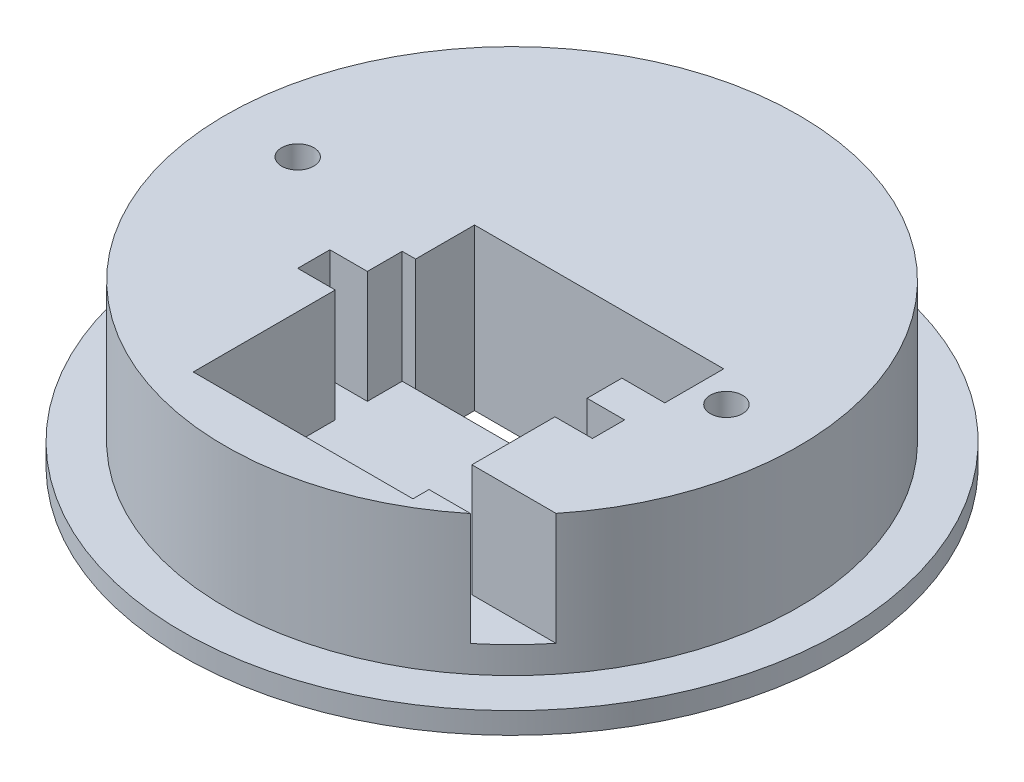
ISO-10303-21;
HEADER;
FILE_DESCRIPTION(('STEP AP214'),'2;1');
FILE_NAME('part.step','',(''),(''),'','','');
FILE_SCHEMA(('AUTOMOTIVE_DESIGN { 1 0 10303 214 1 1 1 1 }'));
ENDSEC;
DATA;
#1=APPLICATION_CONTEXT('core data for automotive mechanical design processes');
#2=APPLICATION_PROTOCOL_DEFINITION('international standard','automotive_design',2000,#1);
#3=PRODUCT_CONTEXT('',#1,'mechanical');
#4=PRODUCT('Part','Part','',(#3));
#5=PRODUCT_RELATED_PRODUCT_CATEGORY('part','',(#4));
#6=PRODUCT_DEFINITION_FORMATION('','',#4);
#7=PRODUCT_DEFINITION_CONTEXT('part definition',#1,'design');
#8=PRODUCT_DEFINITION('design','',#6,#7);
#9=PRODUCT_DEFINITION_SHAPE('','',#8);
#10=(LENGTH_UNIT() NAMED_UNIT(*) SI_UNIT(.MILLI.,.METRE.));
#11=(NAMED_UNIT(*) PLANE_ANGLE_UNIT() SI_UNIT($,.RADIAN.));
#12=(NAMED_UNIT(*) SI_UNIT($,.STERADIAN.) SOLID_ANGLE_UNIT());
#13=UNCERTAINTY_MEASURE_WITH_UNIT(LENGTH_MEASURE(1.E-05),#10,'distance_accuracy_value','');
#14=(GEOMETRIC_REPRESENTATION_CONTEXT(3) GLOBAL_UNCERTAINTY_ASSIGNED_CONTEXT((#13)) GLOBAL_UNIT_ASSIGNED_CONTEXT((#10,
#11,#12)) REPRESENTATION_CONTEXT('',''));
#15=CARTESIAN_POINT('',(0.,0.,0.));
#16=DIRECTION('',(0.,0.,1.));
#17=DIRECTION('',(1.,0.,0.));
#18=AXIS2_PLACEMENT_3D('',#15,#16,#17);
#19=CARTESIAN_POINT('',(16.,19.,-56.4116882454314));
#20=DIRECTION('',(0.,0.,1.));
#21=DIRECTION('',(1.,0.,0.));
#22=AXIS2_PLACEMENT_3D('',#19,#20,#21);
#23=CYLINDRICAL_SURFACE('',#22,18.);
#24=CARTESIAN_POINT('',(16.,19.,5.5));
#25=DIRECTION('',(0.,0.,-1.));
#26=DIRECTION('',(-1.,0.,0.));
#27=AXIS2_PLACEMENT_3D('',#24,#25,#26);
#28=CIRCLE('',#27,18.);
#29=CARTESIAN_POINT('',(34.,19.,5.5));
#30=VERTEX_POINT('',#29);
#31=CARTESIAN_POINT('',(12.5,1.34355641699043,5.5));
#32=VERTEX_POINT('',#31);
#33=EDGE_CURVE('E240',#30,#32,#28,.T.);
#34=ORIENTED_EDGE('',*,*,#33,.F.);
#35=DIRECTION('',(0.,0.,-1.));
#36=VECTOR('',#35,1.);
#37=CARTESIAN_POINT('',(34.,19.,5.5));
#38=LINE('',#37,#36);
#39=CARTESIAN_POINT('',(34.,19.,-5.50000000000001));
#40=VERTEX_POINT('',#39);
#41=EDGE_CURVE('E247',#30,#40,#38,.T.);
#42=ORIENTED_EDGE('',*,*,#41,.T.);
#43=CARTESIAN_POINT('',(16.,19.,-5.50000000000001));
#44=DIRECTION('',(0.,0.,1.));
#45=DIRECTION('',(1.,0.,0.));
#46=AXIS2_PLACEMENT_3D('',#43,#44,#45);
#47=CIRCLE('',#46,18.);
#48=CARTESIAN_POINT('',(12.5,1.34355641699043,-5.5));
#49=VERTEX_POINT('',#48);
#50=EDGE_CURVE('E256',#49,#40,#47,.T.);
#51=ORIENTED_EDGE('',*,*,#50,.F.);
#52=DIRECTION('',(0.,0.,1.));
#53=VECTOR('',#52,1.);
#54=CARTESIAN_POINT('',(12.5,1.34355641699043,-56.4116882454314));
#55=LINE('',#54,#53);
#56=EDGE_CURVE('E254',#32,#49,#55,.F.);
#57=ORIENTED_EDGE('',*,*,#56,.F.);
#58=EDGE_LOOP('',(#34,#42,#51,#57));
#59=FACE_BOUND('',#58,.T.);
#60=ADVANCED_FACE('F82',(#59),#23,.F.);
#61=CARTESIAN_POINT('',(0.,0.,0.));
#62=DIRECTION('',(0.,1.,0.));
#63=DIRECTION('',(0.,0.,1.));
#64=AXIS2_PLACEMENT_3D('',#61,#62,#63);
#65=CYLINDRICAL_SURFACE('',#64,53.5);
#66=CARTESIAN_POINT('',(0.,4.,0.));
#67=DIRECTION('',(0.,-1.,0.));
#68=DIRECTION('',(0.,0.,-1.));
#69=AXIS2_PLACEMENT_3D('',#66,#67,#68);
#70=CIRCLE('',#69,53.5);
#71=CARTESIAN_POINT('',(0.,4.,-53.5));
#72=VERTEX_POINT('',#71);
#73=EDGE_CURVE('E266',#72,#72,#70,.T.);
#74=ORIENTED_EDGE('',*,*,#73,.F.);
#75=EDGE_LOOP('',(#74));
#76=FACE_BOUND('',#75,.T.);
#77=CARTESIAN_POINT('',(0.,30.,0.));
#78=DIRECTION('',(0.,1.,0.));
#79=DIRECTION('',(0.,0.,1.));
#80=AXIS2_PLACEMENT_3D('',#77,#78,#79);
#81=CIRCLE('',#80,53.5);
#82=CARTESIAN_POINT('',(41.7133072292284,30.,33.5));
#83=VERTEX_POINT('',#82);
#84=CARTESIAN_POINT('',(33.7638860322683,30.,41.5));
#85=VERTEX_POINT('',#84);
#86=EDGE_CURVE('E273',#83,#85,#81,.T.);
#87=ORIENTED_EDGE('',*,*,#86,.F.);
#88=DIRECTION('',(0.,1.,0.));
#89=VECTOR('',#88,1.);
#90=CARTESIAN_POINT('',(41.7133072292284,0.,33.5));
#91=LINE('',#90,#89);
#92=CARTESIAN_POINT('',(41.7133072292284,9.,33.5));
#93=VERTEX_POINT('',#92);
#94=EDGE_CURVE('E12',#83,#93,#91,.F.);
#95=ORIENTED_EDGE('',*,*,#94,.T.);
#96=CARTESIAN_POINT('',(0.,9.,0.));
#97=DIRECTION('',(0.,1.,0.));
#98=DIRECTION('',(0.,0.,1.));
#99=AXIS2_PLACEMENT_3D('',#96,#97,#98);
#100=CIRCLE('',#99,53.5);
#101=CARTESIAN_POINT('',(33.7638860322683,9.,41.5));
#102=VERTEX_POINT('',#101);
#103=EDGE_CURVE('E257',#93,#102,#100,.F.);
#104=ORIENTED_EDGE('',*,*,#103,.T.);
#105=DIRECTION('',(0.,1.,0.));
#106=VECTOR('',#105,1.);
#107=CARTESIAN_POINT('',(33.7638860322683,0.,41.5));
#108=LINE('',#107,#106);
#109=EDGE_CURVE('E90',#85,#102,#108,.F.);
#110=ORIENTED_EDGE('',*,*,#109,.F.);
#111=EDGE_LOOP('',(#87,#95,#104,#110));
#112=FACE_BOUND('',#111,.T.);
#113=ADVANCED_FACE('F337',(#76,#112),#65,.T.);
#114=CARTESIAN_POINT('',(-48.8644676542519,30.,-38.9681126161708));
#115=DIRECTION('',(0.,1.,0.));
#116=DIRECTION('',(0.,0.,1.));
#117=AXIS2_PLACEMENT_3D('',#114,#115,#116);
#118=PLANE('',#117);
#119=DIRECTION('',(0.,0.,-1.));
#120=VECTOR('',#119,1.);
#121=CARTESIAN_POINT('',(34.,30.,5.5));
#122=LINE('',#121,#120);
#123=CARTESIAN_POINT('',(34.,30.,5.5));
#124=VERTEX_POINT('',#123);
#125=CARTESIAN_POINT('',(34.,30.,-5.5));
#126=VERTEX_POINT('',#125);
#127=EDGE_CURVE('E251',#124,#126,#122,.T.);
#128=ORIENTED_EDGE('',*,*,#127,.F.);
#129=DIRECTION('',(1.,0.,0.));
#130=VECTOR('',#129,1.);
#131=CARTESIAN_POINT('',(-12.5,30.,5.5));
#132=LINE('',#131,#130);
#133=CARTESIAN_POINT('',(26.,30.,5.5));
#134=VERTEX_POINT('',#133);
#135=EDGE_CURVE('E243',#134,#124,#132,.T.);
#136=ORIENTED_EDGE('',*,*,#135,.F.);
#137=DIRECTION('',(0.,0.,-1.));
#138=VECTOR('',#137,1.);
#139=CARTESIAN_POINT('',(26.,30.,0.));
#140=LINE('',#139,#138);
#141=CARTESIAN_POINT('',(26.,30.,12.));
#142=VERTEX_POINT('',#141);
#143=EDGE_CURVE('E397',#142,#134,#140,.T.);
#144=ORIENTED_EDGE('',*,*,#143,.F.);
#145=DIRECTION('',(1.,0.,0.));
#146=VECTOR('',#145,1.);
#147=CARTESIAN_POINT('',(0.,30.,12.));
#148=LINE('',#147,#146);
#149=CARTESIAN_POINT('',(33.,30.,12.));
#150=VERTEX_POINT('',#149);
#151=EDGE_CURVE('E398',#142,#150,#148,.T.);
#152=ORIENTED_EDGE('',*,*,#151,.T.);
#153=DIRECTION('',(0.,0.,-1.));
#154=VECTOR('',#153,1.);
#155=CARTESIAN_POINT('',(33.,30.,0.));
#156=LINE('',#155,#154);
#157=CARTESIAN_POINT('',(33.,30.,18.));
#158=VERTEX_POINT('',#157);
#159=EDGE_CURVE('E401',#158,#150,#156,.T.);
#160=ORIENTED_EDGE('',*,*,#159,.F.);
#161=DIRECTION('',(1.,0.,0.));
#162=VECTOR('',#161,1.);
#163=CARTESIAN_POINT('',(0.,30.,18.));
#164=LINE('',#163,#162);
#165=CARTESIAN_POINT('',(26.,30.,18.));
#166=VERTEX_POINT('',#165);
#167=EDGE_CURVE('E404',#166,#158,#164,.T.);
#168=ORIENTED_EDGE('',*,*,#167,.F.);
#169=CARTESIAN_POINT('',(26.,30.,33.5));
#170=VERTEX_POINT('',#169);
#171=EDGE_CURVE('E347',#170,#166,#140,.T.);
#172=ORIENTED_EDGE('',*,*,#171,.F.);
#173=DIRECTION('',(1.,0.,0.));
#174=VECTOR('',#173,1.);
#175=CARTESIAN_POINT('',(26.,30.,33.5));
#176=LINE('',#175,#174);
#177=EDGE_CURVE('E335',#170,#83,#176,.T.);
#178=ORIENTED_EDGE('',*,*,#177,.T.);
#179=ORIENTED_EDGE('',*,*,#86,.T.);
#180=DIRECTION('',(1.,0.,0.));
#181=VECTOR('',#180,1.);
#182=CARTESIAN_POINT('',(26.,30.,41.5));
#183=LINE('',#182,#181);
#184=CARTESIAN_POINT('',(26.,30.,41.5));
#185=VERTEX_POINT('',#184);
#186=EDGE_CURVE('E245',#185,#85,#183,.T.);
#187=ORIENTED_EDGE('',*,*,#186,.F.);
#188=CARTESIAN_POINT('',(26.,30.,44.5));
#189=VERTEX_POINT('',#188);
#190=EDGE_CURVE('E407',#189,#185,#140,.T.);
#191=ORIENTED_EDGE('',*,*,#190,.F.);
#192=DIRECTION('',(1.,0.,0.));
#193=VECTOR('',#192,1.);
#194=CARTESIAN_POINT('',(0.,30.,44.5));
#195=LINE('',#194,#193);
#196=CARTESIAN_POINT('',(-15.,30.,44.5));
#197=VERTEX_POINT('',#196);
#198=EDGE_CURVE('E350',#197,#189,#195,.T.);
#199=ORIENTED_EDGE('',*,*,#198,.F.);
#200=DIRECTION('',(0.,0.,-1.));
#201=VECTOR('',#200,1.);
#202=CARTESIAN_POINT('',(-15.,30.,0.));
#203=LINE('',#202,#201);
#204=CARTESIAN_POINT('',(-15.,30.,18.));
#205=VERTEX_POINT('',#204);
#206=EDGE_CURVE('E385',#197,#205,#203,.T.);
#207=ORIENTED_EDGE('',*,*,#206,.T.);
#208=DIRECTION('',(-1.,0.,0.));
#209=VECTOR('',#208,1.);
#210=CARTESIAN_POINT('',(0.,30.,18.));
#211=LINE('',#210,#209);
#212=CARTESIAN_POINT('',(-22.,30.,18.));
#213=VERTEX_POINT('',#212);
#214=EDGE_CURVE('E382',#205,#213,#211,.T.);
#215=ORIENTED_EDGE('',*,*,#214,.T.);
#216=DIRECTION('',(0.,0.,1.));
#217=VECTOR('',#216,1.);
#218=CARTESIAN_POINT('',(-22.,30.,0.));
#219=LINE('',#218,#217);
#220=CARTESIAN_POINT('',(-22.,30.,12.));
#221=VERTEX_POINT('',#220);
#222=EDGE_CURVE('E386',#221,#213,#219,.T.);
#223=ORIENTED_EDGE('',*,*,#222,.F.);
#224=DIRECTION('',(-1.,0.,0.));
#225=VECTOR('',#224,1.);
#226=CARTESIAN_POINT('',(0.,30.,12.));
#227=LINE('',#226,#225);
#228=CARTESIAN_POINT('',(-15.,30.,12.));
#229=VERTEX_POINT('',#228);
#230=EDGE_CURVE('E389',#229,#221,#227,.T.);
#231=ORIENTED_EDGE('',*,*,#230,.F.);
#232=CARTESIAN_POINT('',(-15.,30.,5.5));
#233=VERTEX_POINT('',#232);
#234=EDGE_CURVE('E392',#229,#233,#203,.T.);
#235=ORIENTED_EDGE('',*,*,#234,.T.);
#236=DIRECTION('',(-1.,0.,0.));
#237=VECTOR('',#236,1.);
#238=CARTESIAN_POINT('',(0.,30.,5.5));
#239=LINE('',#238,#237);
#240=CARTESIAN_POINT('',(-12.5,30.,5.50000000000001));
#241=VERTEX_POINT('',#240);
#242=EDGE_CURVE('E395',#241,#233,#239,.T.);
#243=ORIENTED_EDGE('',*,*,#242,.F.);
#244=DIRECTION('',(0.,0.,1.));
#245=VECTOR('',#244,1.);
#246=CARTESIAN_POINT('',(-12.5,30.,-5.5));
#247=LINE('',#246,#245);
#248=CARTESIAN_POINT('',(-12.5,30.,-5.5));
#249=VERTEX_POINT('',#248);
#250=EDGE_CURVE('E291',#249,#241,#247,.T.);
#251=ORIENTED_EDGE('',*,*,#250,.F.);
#252=DIRECTION('',(-1.,0.,0.));
#253=VECTOR('',#252,1.);
#254=CARTESIAN_POINT('',(-12.5,30.,-5.5));
#255=LINE('',#254,#253);
#256=EDGE_CURVE('E296',#126,#249,#255,.T.);
#257=ORIENTED_EDGE('',*,*,#256,.F.);
#258=EDGE_LOOP('',(#128,#136,#144,#152,#160,#168,#172,#178,#179,#187,#191,#199,#207,#215,#223,
#231,#235,#243,#251,#257));
#259=FACE_BOUND('',#258,.T.);
#260=CARTESIAN_POINT('',(40.,30.,0.));
#261=DIRECTION('',(0.,1.,0.));
#262=DIRECTION('',(0.,0.,-1.));
#263=AXIS2_PLACEMENT_3D('',#260,#261,#262);
#264=CIRCLE('',#263,3.);
#265=CARTESIAN_POINT('',(40.,30.,-3.00000000000001));
#266=VERTEX_POINT('',#265);
#267=EDGE_CURVE('E279',#266,#266,#264,.T.);
#268=ORIENTED_EDGE('',*,*,#267,.F.);
#269=EDGE_LOOP('',(#268));
#270=FACE_BOUND('',#269,.T.);
#271=CARTESIAN_POINT('',(-40.,30.,0.));
#272=DIRECTION('',(0.,1.,0.));
#273=DIRECTION('',(0.,0.,1.));
#274=AXIS2_PLACEMENT_3D('',#271,#272,#273);
#275=CIRCLE('',#274,3.);
#276=CARTESIAN_POINT('',(-40.,30.,3.));
#277=VERTEX_POINT('',#276);
#278=EDGE_CURVE('E285',#277,#277,#275,.T.);
#279=ORIENTED_EDGE('',*,*,#278,.F.);
#280=EDGE_LOOP('',(#279));
#281=FACE_BOUND('',#280,.T.);
#282=ADVANCED_FACE('F344',(#259,#270,#281),#118,.T.);
#283=CARTESIAN_POINT('',(12.5,30.,-5.5));
#284=DIRECTION('',(-1.,0.,0.));
#285=DIRECTION('',(0.,0.,1.));
#286=AXIS2_PLACEMENT_3D('',#283,#284,#285);
#287=PLANE('',#286);
#288=DIRECTION('',(0.,-1.,0.));
#289=VECTOR('',#288,1.);
#290=CARTESIAN_POINT('',(12.5,30.,5.5));
#291=LINE('',#290,#289);
#292=CARTESIAN_POINT('',(12.5,0.,5.5));
#293=VERTEX_POINT('',#292);
#294=EDGE_CURVE('E313',#32,#293,#291,.T.);
#295=ORIENTED_EDGE('',*,*,#294,.F.);
#296=ORIENTED_EDGE('',*,*,#56,.T.);
#297=DIRECTION('',(0.,-1.,0.));
#298=VECTOR('',#297,1.);
#299=CARTESIAN_POINT('',(12.5,30.,-5.5));
#300=LINE('',#299,#298);
#301=CARTESIAN_POINT('',(12.5,0.,-5.5));
#302=VERTEX_POINT('',#301);
#303=EDGE_CURVE('E311',#49,#302,#300,.T.);
#304=ORIENTED_EDGE('',*,*,#303,.T.);
#305=DIRECTION('',(0.,0.,-1.));
#306=VECTOR('',#305,1.);
#307=CARTESIAN_POINT('',(12.5,0.,-5.5));
#308=LINE('',#307,#306);
#309=EDGE_CURVE('E304',#293,#302,#308,.T.);
#310=ORIENTED_EDGE('',*,*,#309,.F.);
#311=EDGE_LOOP('',(#295,#296,#304,#310));
#312=FACE_BOUND('',#311,.T.);
#313=ADVANCED_FACE('F448',(#312),#287,.T.);
#314=CARTESIAN_POINT('',(-48.8644676542519,0.,-38.9681126161708));
#315=DIRECTION('',(0.,1.,0.));
#316=DIRECTION('',(0.,0.,1.));
#317=AXIS2_PLACEMENT_3D('',#314,#315,#316);
#318=PLANE('',#317);
#319=CARTESIAN_POINT('',(40.,0.,0.));
#320=DIRECTION('',(0.,1.,0.));
#321=DIRECTION('',(0.,0.,-1.));
#322=AXIS2_PLACEMENT_3D('',#319,#320,#321);
#323=CIRCLE('',#322,3.);
#324=CARTESIAN_POINT('',(40.,0.,-3.00000000000001));
#325=VERTEX_POINT('',#324);
#326=EDGE_CURVE('E278',#325,#325,#323,.T.);
#327=ORIENTED_EDGE('',*,*,#326,.T.);
#328=EDGE_LOOP('',(#327));
#329=FACE_BOUND('',#328,.T.);
#330=CARTESIAN_POINT('',(-40.,0.,0.));
#331=DIRECTION('',(0.,1.,0.));
#332=DIRECTION('',(0.,0.,1.));
#333=AXIS2_PLACEMENT_3D('',#330,#331,#332);
#334=CIRCLE('',#333,3.);
#335=CARTESIAN_POINT('',(-40.,0.,3.));
#336=VERTEX_POINT('',#335);
#337=EDGE_CURVE('E282',#336,#336,#334,.T.);
#338=ORIENTED_EDGE('',*,*,#337,.T.);
#339=EDGE_LOOP('',(#338));
#340=FACE_BOUND('',#339,.T.);
#341=DIRECTION('',(0.,0.,1.));
#342=VECTOR('',#341,1.);
#343=CARTESIAN_POINT('',(-12.5,0.,-5.5));
#344=LINE('',#343,#342);
#345=CARTESIAN_POINT('',(-12.5,0.,-5.5));
#346=VERTEX_POINT('',#345);
#347=CARTESIAN_POINT('',(-12.5,0.,5.5));
#348=VERTEX_POINT('',#347);
#349=EDGE_CURVE('E288',#346,#348,#344,.T.);
#350=ORIENTED_EDGE('',*,*,#349,.T.);
#351=DIRECTION('',(1.,0.,0.));
#352=VECTOR('',#351,1.);
#353=CARTESIAN_POINT('',(-12.5,0.,5.5));
#354=LINE('',#353,#352);
#355=EDGE_CURVE('E301',#348,#293,#354,.T.);
#356=ORIENTED_EDGE('',*,*,#355,.T.);
#357=ORIENTED_EDGE('',*,*,#309,.T.);
#358=DIRECTION('',(-1.,0.,0.));
#359=VECTOR('',#358,1.);
#360=CARTESIAN_POINT('',(-12.5,0.,-5.5));
#361=LINE('',#360,#359);
#362=EDGE_CURVE('E294',#302,#346,#361,.T.);
#363=ORIENTED_EDGE('',*,*,#362,.T.);
#364=EDGE_LOOP('',(#350,#356,#357,#363));
#365=FACE_BOUND('',#364,.T.);
#366=CARTESIAN_POINT('',(0.,0.,0.));
#367=DIRECTION('',(0.,-1.,0.));
#368=DIRECTION('',(0.,0.,-1.));
#369=AXIS2_PLACEMENT_3D('',#366,#367,#368);
#370=CIRCLE('',#369,61.5);
#371=CARTESIAN_POINT('',(0.,0.,-61.5));
#372=VERTEX_POINT('',#371);
#373=EDGE_CURVE('E269',#372,#372,#370,.T.);
#374=ORIENTED_EDGE('',*,*,#373,.T.);
#375=EDGE_LOOP('',(#374));
#376=FACE_BOUND('',#375,.T.);
#377=ADVANCED_FACE('F84',(#329,#340,#365,#376),#318,.F.);
#378=CARTESIAN_POINT('',(-12.5,30.,-5.5));
#379=DIRECTION('',(1.,0.,0.));
#380=DIRECTION('',(0.,0.,-1.));
#381=AXIS2_PLACEMENT_3D('',#378,#379,#380);
#382=PLANE('',#381);
#383=ORIENTED_EDGE('',*,*,#349,.F.);
#384=DIRECTION('',(0.,-1.,0.));
#385=VECTOR('',#384,1.);
#386=CARTESIAN_POINT('',(-12.5,30.,-5.5));
#387=LINE('',#386,#385);
#388=EDGE_CURVE('E298',#249,#346,#387,.T.);
#389=ORIENTED_EDGE('',*,*,#388,.F.);
#390=ORIENTED_EDGE('',*,*,#250,.T.);
#391=DIRECTION('',(0.,-1.,0.));
#392=VECTOR('',#391,1.);
#393=CARTESIAN_POINT('',(-12.5,30.,5.5));
#394=LINE('',#393,#392);
#395=CARTESIAN_POINT('',(-12.5,9.,5.50000000000001));
#396=VERTEX_POINT('',#395);
#397=EDGE_CURVE('E316',#241,#396,#394,.T.);
#398=ORIENTED_EDGE('',*,*,#397,.T.);
#399=EDGE_CURVE('E315',#396,#348,#394,.T.);
#400=ORIENTED_EDGE('',*,*,#399,.T.);
#401=EDGE_LOOP('',(#383,#389,#390,#398,#400));
#402=FACE_BOUND('',#401,.T.);
#403=ADVANCED_FACE('F456',(#402),#382,.T.);
#404=CARTESIAN_POINT('',(-12.5,30.,5.5));
#405=DIRECTION('',(0.,0.,-1.));
#406=DIRECTION('',(-1.,0.,0.));
#407=AXIS2_PLACEMENT_3D('',#404,#405,#406);
#408=PLANE('',#407);
#409=DIRECTION('',(0.,1.,0.));
#410=VECTOR('',#409,1.);
#411=CARTESIAN_POINT('',(34.,19.,5.5));
#412=LINE('',#411,#410);
#413=EDGE_CURVE('E237',#30,#124,#412,.T.);
#414=ORIENTED_EDGE('',*,*,#413,.F.);
#415=ORIENTED_EDGE('',*,*,#33,.T.);
#416=ORIENTED_EDGE('',*,*,#294,.T.);
#417=ORIENTED_EDGE('',*,*,#355,.F.);
#418=ORIENTED_EDGE('',*,*,#399,.F.);
#419=DIRECTION('',(-1.,0.,0.));
#420=VECTOR('',#419,1.);
#421=CARTESIAN_POINT('',(0.,9.,5.5));
#422=LINE('',#421,#420);
#423=CARTESIAN_POINT('',(26.,9.,5.49999999999999));
#424=VERTEX_POINT('',#423);
#425=EDGE_CURVE('E423',#424,#396,#422,.T.);
#426=ORIENTED_EDGE('',*,*,#425,.F.);
#427=DIRECTION('',(0.,1.,0.));
#428=VECTOR('',#427,1.);
#429=CARTESIAN_POINT('',(26.,9.,5.5));
#430=LINE('',#429,#428);
#431=EDGE_CURVE('E368',#424,#134,#430,.T.);
#432=ORIENTED_EDGE('',*,*,#431,.T.);
#433=ORIENTED_EDGE('',*,*,#135,.T.);
#434=EDGE_LOOP('',(#414,#415,#416,#417,#418,#426,#432,#433));
#435=FACE_BOUND('',#434,.T.);
#436=ADVANCED_FACE('F238',(#435),#408,.T.);
#437=CARTESIAN_POINT('',(-12.5,30.,-5.5));
#438=DIRECTION('',(0.,0.,1.));
#439=DIRECTION('',(1.,0.,0.));
#440=AXIS2_PLACEMENT_3D('',#437,#438,#439);
#441=PLANE('',#440);
#442=ORIENTED_EDGE('',*,*,#256,.T.);
#443=ORIENTED_EDGE('',*,*,#388,.T.);
#444=ORIENTED_EDGE('',*,*,#362,.F.);
#445=ORIENTED_EDGE('',*,*,#303,.F.);
#446=ORIENTED_EDGE('',*,*,#50,.T.);
#447=DIRECTION('',(0.,1.,0.));
#448=VECTOR('',#447,1.);
#449=CARTESIAN_POINT('',(34.,19.,-5.5));
#450=LINE('',#449,#448);
#451=EDGE_CURVE('E97',#40,#126,#450,.T.);
#452=ORIENTED_EDGE('',*,*,#451,.T.);
#453=EDGE_LOOP('',(#442,#443,#444,#445,#446,#452));
#454=FACE_BOUND('',#453,.T.);
#455=ADVANCED_FACE('F444',(#454),#441,.T.);
#456=CARTESIAN_POINT('',(-40.,30.,0.));
#457=DIRECTION('',(0.,-1.,0.));
#458=DIRECTION('',(0.,0.,-1.));
#459=AXIS2_PLACEMENT_3D('',#456,#457,#458);
#460=CYLINDRICAL_SURFACE('',#459,3.);
#461=ORIENTED_EDGE('',*,*,#278,.T.);
#462=EDGE_LOOP('',(#461));
#463=FACE_BOUND('',#462,.T.);
#464=ORIENTED_EDGE('',*,*,#337,.F.);
#465=EDGE_LOOP('',(#464));
#466=FACE_BOUND('',#465,.T.);
#467=ADVANCED_FACE('F527',(#463,#466),#460,.F.);
#468=CARTESIAN_POINT('',(40.,30.,0.));
#469=DIRECTION('',(0.,-1.,0.));
#470=DIRECTION('',(0.,0.,-1.));
#471=AXIS2_PLACEMENT_3D('',#468,#469,#470);
#472=CYLINDRICAL_SURFACE('',#471,3.);
#473=ORIENTED_EDGE('',*,*,#267,.T.);
#474=EDGE_LOOP('',(#473));
#475=FACE_BOUND('',#474,.T.);
#476=ORIENTED_EDGE('',*,*,#326,.F.);
#477=EDGE_LOOP('',(#476));
#478=FACE_BOUND('',#477,.T.);
#479=ADVANCED_FACE('F522',(#475,#478),#472,.F.);
#480=CARTESIAN_POINT('',(0.,4.,0.));
#481=DIRECTION('',(0.,-1.,0.));
#482=DIRECTION('',(0.,0.,-1.));
#483=AXIS2_PLACEMENT_3D('',#480,#481,#482);
#484=CYLINDRICAL_SURFACE('',#483,61.5);
#485=CARTESIAN_POINT('',(0.,4.,0.));
#486=DIRECTION('',(0.,-1.,0.));
#487=DIRECTION('',(0.,0.,-1.));
#488=AXIS2_PLACEMENT_3D('',#485,#486,#487);
#489=CIRCLE('',#488,61.5);
#490=CARTESIAN_POINT('',(0.,4.,-61.5));
#491=VERTEX_POINT('',#490);
#492=EDGE_CURVE('E270',#491,#491,#489,.T.);
#493=ORIENTED_EDGE('',*,*,#492,.T.);
#494=EDGE_LOOP('',(#493));
#495=FACE_BOUND('',#494,.T.);
#496=ORIENTED_EDGE('',*,*,#373,.F.);
#497=EDGE_LOOP('',(#496));
#498=FACE_BOUND('',#497,.T.);
#499=ADVANCED_FACE('F519',(#495,#498),#484,.T.);
#500=CARTESIAN_POINT('',(0.,4.,0.));
#501=DIRECTION('',(0.,-1.,0.));
#502=DIRECTION('',(0.,0.,-1.));
#503=AXIS2_PLACEMENT_3D('',#500,#501,#502);
#504=PLANE('',#503);
#505=ORIENTED_EDGE('',*,*,#73,.T.);
#506=EDGE_LOOP('',(#505));
#507=FACE_BOUND('',#506,.T.);
#508=ORIENTED_EDGE('',*,*,#492,.F.);
#509=EDGE_LOOP('',(#508));
#510=FACE_BOUND('',#509,.T.);
#511=ADVANCED_FACE('F516',(#507,#510),#504,.F.);
#512=CARTESIAN_POINT('',(-15.,9.,0.));
#513=DIRECTION('',(1.,0.,0.));
#514=DIRECTION('',(0.,0.,-1.));
#515=AXIS2_PLACEMENT_3D('',#512,#513,#514);
#516=PLANE('',#515);
#517=ORIENTED_EDGE('',*,*,#206,.F.);
#518=DIRECTION('',(0.,1.,0.));
#519=VECTOR('',#518,1.);
#520=CARTESIAN_POINT('',(-15.,9.,44.5));
#521=LINE('',#520,#519);
#522=CARTESIAN_POINT('',(-15.,9.,44.5));
#523=VERTEX_POINT('',#522);
#524=EDGE_CURVE('E355',#523,#197,#521,.T.);
#525=ORIENTED_EDGE('',*,*,#524,.F.);
#526=DIRECTION('',(0.,0.,-1.));
#527=VECTOR('',#526,1.);
#528=CARTESIAN_POINT('',(-15.,9.,0.));
#529=LINE('',#528,#527);
#530=CARTESIAN_POINT('',(-15.,9.,18.));
#531=VERTEX_POINT('',#530);
#532=EDGE_CURVE('E359',#523,#531,#529,.T.);
#533=ORIENTED_EDGE('',*,*,#532,.T.);
#534=DIRECTION('',(0.,1.,0.));
#535=VECTOR('',#534,1.);
#536=CARTESIAN_POINT('',(-15.,9.,18.));
#537=LINE('',#536,#535);
#538=EDGE_CURVE('E379',#531,#205,#537,.T.);
#539=ORIENTED_EDGE('',*,*,#538,.T.);
#540=EDGE_LOOP('',(#517,#525,#533,#539));
#541=FACE_BOUND('',#540,.T.);
#542=ADVANCED_FACE('F483',(#541),#516,.T.);
#543=CARTESIAN_POINT('',(0.,9.,18.));
#544=DIRECTION('',(0.,0.,-1.));
#545=DIRECTION('',(-1.,0.,0.));
#546=AXIS2_PLACEMENT_3D('',#543,#544,#545);
#547=PLANE('',#546);
#548=ORIENTED_EDGE('',*,*,#214,.F.);
#549=ORIENTED_EDGE('',*,*,#538,.F.);
#550=DIRECTION('',(-1.,0.,0.));
#551=VECTOR('',#550,1.);
#552=CARTESIAN_POINT('',(0.,9.,18.));
#553=LINE('',#552,#551);
#554=CARTESIAN_POINT('',(-22.,9.,18.));
#555=VERTEX_POINT('',#554);
#556=EDGE_CURVE('E412',#531,#555,#553,.T.);
#557=ORIENTED_EDGE('',*,*,#556,.T.);
#558=DIRECTION('',(0.,1.,0.));
#559=VECTOR('',#558,1.);
#560=CARTESIAN_POINT('',(-22.,9.,18.));
#561=LINE('',#560,#559);
#562=EDGE_CURVE('E377',#555,#213,#561,.T.);
#563=ORIENTED_EDGE('',*,*,#562,.T.);
#564=EDGE_LOOP('',(#548,#549,#557,#563));
#565=FACE_BOUND('',#564,.T.);
#566=ADVANCED_FACE('F479',(#565),#547,.T.);
#567=CARTESIAN_POINT('',(-22.,9.,0.));
#568=DIRECTION('',(-1.,0.,0.));
#569=DIRECTION('',(0.,0.,1.));
#570=AXIS2_PLACEMENT_3D('',#567,#568,#569);
#571=PLANE('',#570);
#572=ORIENTED_EDGE('',*,*,#222,.T.);
#573=ORIENTED_EDGE('',*,*,#562,.F.);
#574=DIRECTION('',(0.,0.,1.));
#575=VECTOR('',#574,1.);
#576=CARTESIAN_POINT('',(-22.,9.,0.));
#577=LINE('',#576,#575);
#578=CARTESIAN_POINT('',(-22.,9.,12.));
#579=VERTEX_POINT('',#578);
#580=EDGE_CURVE('E414',#579,#555,#577,.T.);
#581=ORIENTED_EDGE('',*,*,#580,.F.);
#582=DIRECTION('',(0.,1.,0.));
#583=VECTOR('',#582,1.);
#584=CARTESIAN_POINT('',(-22.,9.,12.));
#585=LINE('',#584,#583);
#586=EDGE_CURVE('E375',#579,#221,#585,.T.);
#587=ORIENTED_EDGE('',*,*,#586,.T.);
#588=EDGE_LOOP('',(#572,#573,#581,#587));
#589=FACE_BOUND('',#588,.T.);
#590=ADVANCED_FACE('F472',(#589),#571,.F.);
#591=CARTESIAN_POINT('',(0.,9.,12.));
#592=DIRECTION('',(0.,0.,-1.));
#593=DIRECTION('',(-1.,0.,0.));
#594=AXIS2_PLACEMENT_3D('',#591,#592,#593);
#595=PLANE('',#594);
#596=ORIENTED_EDGE('',*,*,#230,.T.);
#597=ORIENTED_EDGE('',*,*,#586,.F.);
#598=DIRECTION('',(-1.,0.,0.));
#599=VECTOR('',#598,1.);
#600=CARTESIAN_POINT('',(0.,9.,12.));
#601=LINE('',#600,#599);
#602=CARTESIAN_POINT('',(-15.,9.,12.));
#603=VERTEX_POINT('',#602);
#604=EDGE_CURVE('E417',#603,#579,#601,.T.);
#605=ORIENTED_EDGE('',*,*,#604,.F.);
#606=DIRECTION('',(0.,1.,0.));
#607=VECTOR('',#606,1.);
#608=CARTESIAN_POINT('',(-15.,9.,12.));
#609=LINE('',#608,#607);
#610=EDGE_CURVE('E373',#603,#229,#609,.T.);
#611=ORIENTED_EDGE('',*,*,#610,.T.);
#612=EDGE_LOOP('',(#596,#597,#605,#611));
#613=FACE_BOUND('',#612,.T.);
#614=ADVANCED_FACE('F468',(#613),#595,.F.);
#615=ORIENTED_EDGE('',*,*,#234,.F.);
#616=ORIENTED_EDGE('',*,*,#610,.F.);
#617=CARTESIAN_POINT('',(-15.,9.,5.5));
#618=VERTEX_POINT('',#617);
#619=EDGE_CURVE('E420',#603,#618,#529,.T.);
#620=ORIENTED_EDGE('',*,*,#619,.T.);
#621=DIRECTION('',(0.,1.,0.));
#622=VECTOR('',#621,1.);
#623=CARTESIAN_POINT('',(-15.,9.,5.5));
#624=LINE('',#623,#622);
#625=EDGE_CURVE('E370',#618,#233,#624,.T.);
#626=ORIENTED_EDGE('',*,*,#625,.T.);
#627=EDGE_LOOP('',(#615,#616,#620,#626));
#628=FACE_BOUND('',#627,.T.);
#629=ADVANCED_FACE('F464',(#628),#516,.T.);
#630=CARTESIAN_POINT('',(0.,9.,5.5));
#631=DIRECTION('',(0.,0.,-1.));
#632=DIRECTION('',(-1.,0.,0.));
#633=AXIS2_PLACEMENT_3D('',#630,#631,#632);
#634=PLANE('',#633);
#635=ORIENTED_EDGE('',*,*,#397,.F.);
#636=ORIENTED_EDGE('',*,*,#242,.T.);
#637=ORIENTED_EDGE('',*,*,#625,.F.);
#638=EDGE_CURVE('E425',#396,#618,#422,.T.);
#639=ORIENTED_EDGE('',*,*,#638,.F.);
#640=EDGE_LOOP('',(#635,#636,#637,#639));
#641=FACE_BOUND('',#640,.T.);
#642=ADVANCED_FACE('F458',(#641),#634,.F.);
#643=CARTESIAN_POINT('',(26.,9.,0.));
#644=DIRECTION('',(1.,0.,0.));
#645=DIRECTION('',(0.,0.,-1.));
#646=AXIS2_PLACEMENT_3D('',#643,#644,#645);
#647=PLANE('',#646);
#648=ORIENTED_EDGE('',*,*,#143,.T.);
#649=ORIENTED_EDGE('',*,*,#431,.F.);
#650=DIRECTION('',(0.,0.,-1.));
#651=VECTOR('',#650,1.);
#652=CARTESIAN_POINT('',(26.,9.,0.));
#653=LINE('',#652,#651);
#654=CARTESIAN_POINT('',(26.,9.,12.));
#655=VERTEX_POINT('',#654);
#656=EDGE_CURVE('E105',#655,#424,#653,.T.);
#657=ORIENTED_EDGE('',*,*,#656,.F.);
#658=DIRECTION('',(0.,1.,0.));
#659=VECTOR('',#658,1.);
#660=CARTESIAN_POINT('',(26.,9.,12.));
#661=LINE('',#660,#659);
#662=EDGE_CURVE('E366',#655,#142,#661,.T.);
#663=ORIENTED_EDGE('',*,*,#662,.T.);
#664=EDGE_LOOP('',(#648,#649,#657,#663));
#665=FACE_BOUND('',#664,.T.);
#666=ADVANCED_FACE('F493',(#665),#647,.F.);
#667=CARTESIAN_POINT('',(0.,9.,12.));
#668=DIRECTION('',(0.,0.,1.));
#669=DIRECTION('',(1.,0.,0.));
#670=AXIS2_PLACEMENT_3D('',#667,#668,#669);
#671=PLANE('',#670);
#672=ORIENTED_EDGE('',*,*,#151,.F.);
#673=ORIENTED_EDGE('',*,*,#662,.F.);
#674=DIRECTION('',(1.,0.,0.));
#675=VECTOR('',#674,1.);
#676=CARTESIAN_POINT('',(0.,9.,12.));
#677=LINE('',#676,#675);
#678=CARTESIAN_POINT('',(33.,9.,12.));
#679=VERTEX_POINT('',#678);
#680=EDGE_CURVE('E426',#655,#679,#677,.T.);
#681=ORIENTED_EDGE('',*,*,#680,.T.);
#682=DIRECTION('',(0.,1.,0.));
#683=VECTOR('',#682,1.);
#684=CARTESIAN_POINT('',(33.,9.,12.));
#685=LINE('',#684,#683);
#686=EDGE_CURVE('E364',#679,#150,#685,.T.);
#687=ORIENTED_EDGE('',*,*,#686,.T.);
#688=EDGE_LOOP('',(#672,#673,#681,#687));
#689=FACE_BOUND('',#688,.T.);
#690=ADVANCED_FACE('F504',(#689),#671,.T.);
#691=CARTESIAN_POINT('',(33.,9.,0.));
#692=DIRECTION('',(1.,0.,0.));
#693=DIRECTION('',(0.,0.,-1.));
#694=AXIS2_PLACEMENT_3D('',#691,#692,#693);
#695=PLANE('',#694);
#696=ORIENTED_EDGE('',*,*,#159,.T.);
#697=ORIENTED_EDGE('',*,*,#686,.F.);
#698=DIRECTION('',(0.,0.,-1.));
#699=VECTOR('',#698,1.);
#700=CARTESIAN_POINT('',(33.,9.,0.));
#701=LINE('',#700,#699);
#702=CARTESIAN_POINT('',(33.,9.,18.));
#703=VERTEX_POINT('',#702);
#704=EDGE_CURVE('E428',#703,#679,#701,.T.);
#705=ORIENTED_EDGE('',*,*,#704,.F.);
#706=DIRECTION('',(0.,1.,0.));
#707=VECTOR('',#706,1.);
#708=CARTESIAN_POINT('',(33.,9.,18.));
#709=LINE('',#708,#707);
#710=EDGE_CURVE('E362',#703,#158,#709,.T.);
#711=ORIENTED_EDGE('',*,*,#710,.T.);
#712=EDGE_LOOP('',(#696,#697,#705,#711));
#713=FACE_BOUND('',#712,.T.);
#714=ADVANCED_FACE('F627',(#713),#695,.F.);
#715=CARTESIAN_POINT('',(0.,9.,18.));
#716=DIRECTION('',(0.,0.,1.));
#717=DIRECTION('',(1.,0.,0.));
#718=AXIS2_PLACEMENT_3D('',#715,#716,#717);
#719=PLANE('',#718);
#720=ORIENTED_EDGE('',*,*,#167,.T.);
#721=ORIENTED_EDGE('',*,*,#710,.F.);
#722=DIRECTION('',(1.,0.,0.));
#723=VECTOR('',#722,1.);
#724=CARTESIAN_POINT('',(0.,9.,18.));
#725=LINE('',#724,#723);
#726=CARTESIAN_POINT('',(26.,9.,18.));
#727=VERTEX_POINT('',#726);
#728=EDGE_CURVE('E431',#727,#703,#725,.T.);
#729=ORIENTED_EDGE('',*,*,#728,.F.);
#730=DIRECTION('',(0.,1.,0.));
#731=VECTOR('',#730,1.);
#732=CARTESIAN_POINT('',(26.,9.,18.));
#733=LINE('',#732,#731);
#734=EDGE_CURVE('E358',#727,#166,#733,.T.);
#735=ORIENTED_EDGE('',*,*,#734,.T.);
#736=EDGE_LOOP('',(#720,#721,#729,#735));
#737=FACE_BOUND('',#736,.T.);
#738=ADVANCED_FACE('F499',(#737),#719,.F.);
#739=ORIENTED_EDGE('',*,*,#171,.T.);
#740=ORIENTED_EDGE('',*,*,#734,.F.);
#741=CARTESIAN_POINT('',(26.,9.,33.5));
#742=VERTEX_POINT('',#741);
#743=EDGE_CURVE('E435',#742,#727,#653,.T.);
#744=ORIENTED_EDGE('',*,*,#743,.F.);
#745=DIRECTION('',(0.,-1.,0.));
#746=VECTOR('',#745,1.);
#747=CARTESIAN_POINT('',(26.,9.,33.5));
#748=LINE('',#747,#746);
#749=EDGE_CURVE('E353',#170,#742,#748,.T.);
#750=ORIENTED_EDGE('',*,*,#749,.F.);
#751=EDGE_LOOP('',(#739,#740,#744,#750));
#752=FACE_BOUND('',#751,.T.);
#753=ADVANCED_FACE('F491',(#752),#647,.F.);
#754=DIRECTION('',(0.,-1.,0.));
#755=VECTOR('',#754,1.);
#756=CARTESIAN_POINT('',(26.,9.,41.5));
#757=LINE('',#756,#755);
#758=CARTESIAN_POINT('',(26.,9.,41.5));
#759=VERTEX_POINT('',#758);
#760=EDGE_CURVE('E261',#185,#759,#757,.T.);
#761=ORIENTED_EDGE('',*,*,#760,.T.);
#762=CARTESIAN_POINT('',(26.,9.,44.5));
#763=VERTEX_POINT('',#762);
#764=EDGE_CURVE('E333',#763,#759,#653,.T.);
#765=ORIENTED_EDGE('',*,*,#764,.F.);
#766=DIRECTION('',(0.,1.,0.));
#767=VECTOR('',#766,1.);
#768=CARTESIAN_POINT('',(26.,9.,44.5));
#769=LINE('',#768,#767);
#770=EDGE_CURVE('E356',#763,#189,#769,.T.);
#771=ORIENTED_EDGE('',*,*,#770,.T.);
#772=ORIENTED_EDGE('',*,*,#190,.T.);
#773=EDGE_LOOP('',(#761,#765,#771,#772));
#774=FACE_BOUND('',#773,.T.);
#775=ADVANCED_FACE('F489',(#774),#647,.F.);
#776=CARTESIAN_POINT('',(0.,9.,44.5));
#777=DIRECTION('',(0.,0.,1.));
#778=DIRECTION('',(1.,0.,0.));
#779=AXIS2_PLACEMENT_3D('',#776,#777,#778);
#780=PLANE('',#779);
#781=ORIENTED_EDGE('',*,*,#198,.T.);
#782=ORIENTED_EDGE('',*,*,#770,.F.);
#783=DIRECTION('',(1.,0.,0.));
#784=VECTOR('',#783,1.);
#785=CARTESIAN_POINT('',(0.,9.,44.5));
#786=LINE('',#785,#784);
#787=EDGE_CURVE('E436',#523,#763,#786,.T.);
#788=ORIENTED_EDGE('',*,*,#787,.F.);
#789=ORIENTED_EDGE('',*,*,#524,.T.);
#790=EDGE_LOOP('',(#781,#782,#788,#789));
#791=FACE_BOUND('',#790,.T.);
#792=ADVANCED_FACE('F486',(#791),#780,.F.);
#793=CARTESIAN_POINT('',(0.,9.,0.));
#794=DIRECTION('',(0.,1.,0.));
#795=DIRECTION('',(0.,0.,1.));
#796=AXIS2_PLACEMENT_3D('',#793,#794,#795);
#797=PLANE('',#796);
#798=DIRECTION('',(1.,0.,0.));
#799=VECTOR('',#798,1.);
#800=CARTESIAN_POINT('',(26.,9.,33.5));
#801=LINE('',#800,#799);
#802=EDGE_CURVE('E334',#742,#93,#801,.T.);
#803=ORIENTED_EDGE('',*,*,#802,.F.);
#804=ORIENTED_EDGE('',*,*,#743,.T.);
#805=ORIENTED_EDGE('',*,*,#728,.T.);
#806=ORIENTED_EDGE('',*,*,#704,.T.);
#807=ORIENTED_EDGE('',*,*,#680,.F.);
#808=ORIENTED_EDGE('',*,*,#656,.T.);
#809=ORIENTED_EDGE('',*,*,#425,.T.);
#810=ORIENTED_EDGE('',*,*,#638,.T.);
#811=ORIENTED_EDGE('',*,*,#619,.F.);
#812=ORIENTED_EDGE('',*,*,#604,.T.);
#813=ORIENTED_EDGE('',*,*,#580,.T.);
#814=ORIENTED_EDGE('',*,*,#556,.F.);
#815=ORIENTED_EDGE('',*,*,#532,.F.);
#816=ORIENTED_EDGE('',*,*,#787,.T.);
#817=ORIENTED_EDGE('',*,*,#764,.T.);
#818=DIRECTION('',(1.,0.,0.));
#819=VECTOR('',#818,1.);
#820=CARTESIAN_POINT('',(26.,9.,41.5));
#821=LINE('',#820,#819);
#822=EDGE_CURVE('E323',#759,#102,#821,.T.);
#823=ORIENTED_EDGE('',*,*,#822,.T.);
#824=ORIENTED_EDGE('',*,*,#103,.F.);
#825=EDGE_LOOP('',(#803,#804,#805,#806,#807,#808,#809,#810,#811,#812,#813,#814,#815,#816,#817,
#823,#824));
#826=FACE_BOUND('',#825,.T.);
#827=ADVANCED_FACE('F329',(#826),#797,.T.);
#828=CARTESIAN_POINT('',(26.,9.,33.5));
#829=DIRECTION('',(0.,0.,1.));
#830=DIRECTION('',(1.,0.,0.));
#831=AXIS2_PLACEMENT_3D('',#828,#829,#830);
#832=PLANE('',#831);
#833=ORIENTED_EDGE('',*,*,#177,.F.);
#834=ORIENTED_EDGE('',*,*,#749,.T.);
#835=ORIENTED_EDGE('',*,*,#802,.T.);
#836=ORIENTED_EDGE('',*,*,#94,.F.);
#837=EDGE_LOOP('',(#833,#834,#835,#836));
#838=FACE_BOUND('',#837,.T.);
#839=ADVANCED_FACE('F341',(#838),#832,.T.);
#840=CARTESIAN_POINT('',(26.,9.,41.5));
#841=DIRECTION('',(0.,0.,1.));
#842=DIRECTION('',(1.,0.,0.));
#843=AXIS2_PLACEMENT_3D('',#840,#841,#842);
#844=PLANE('',#843);
#845=ORIENTED_EDGE('',*,*,#109,.T.);
#846=ORIENTED_EDGE('',*,*,#822,.F.);
#847=ORIENTED_EDGE('',*,*,#760,.F.);
#848=ORIENTED_EDGE('',*,*,#186,.T.);
#849=EDGE_LOOP('',(#845,#846,#847,#848));
#850=FACE_BOUND('',#849,.T.);
#851=ADVANCED_FACE('F322',(#850),#844,.F.);
#852=CARTESIAN_POINT('',(34.,19.,5.5));
#853=DIRECTION('',(1.,0.,0.));
#854=DIRECTION('',(0.,0.,-1.));
#855=AXIS2_PLACEMENT_3D('',#852,#853,#854);
#856=PLANE('',#855);
#857=ORIENTED_EDGE('',*,*,#127,.T.);
#858=ORIENTED_EDGE('',*,*,#451,.F.);
#859=ORIENTED_EDGE('',*,*,#41,.F.);
#860=ORIENTED_EDGE('',*,*,#413,.T.);
#861=EDGE_LOOP('',(#857,#858,#859,#860));
#862=FACE_BOUND('',#861,.T.);
#863=ADVANCED_FACE('F248',(#862),#856,.F.);
#864=CLOSED_SHELL('',(#60,#113,#282,#313,#377,#403,#436,#455,#467,#479,#499,#511,#542,#566,#590,
#614,#629,#642,#666,#690,#714,#738,#753,#775,#792,#827,#839,#851,#863));
#865=MANIFOLD_SOLID_BREP('B2',#864);
#866=ADVANCED_BREP_SHAPE_REPRESENTATION('',(#18,#865),#14);
#867=SHAPE_DEFINITION_REPRESENTATION(#9,#866);
ENDSEC;
END-ISO-10303-21;
